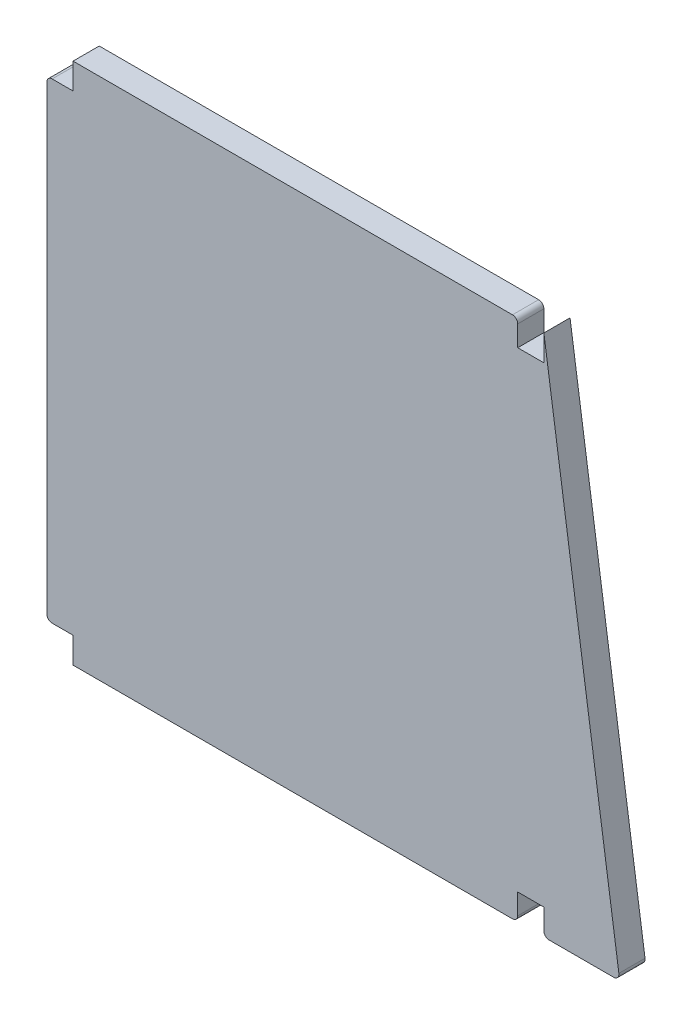
ISO-10303-21;
HEADER;
FILE_DESCRIPTION(('STEP AP214'),'2;1');
FILE_NAME('part.step','',(''),(''),'','','');
FILE_SCHEMA(('AUTOMOTIVE_DESIGN { 1 0 10303 214 1 1 1 1 }'));
ENDSEC;
DATA;
#1=APPLICATION_CONTEXT('core data for automotive mechanical design processes');
#2=APPLICATION_PROTOCOL_DEFINITION('international standard','automotive_design',2000,#1);
#3=PRODUCT_CONTEXT('',#1,'mechanical');
#4=PRODUCT('Part','Part','',(#3));
#5=PRODUCT_RELATED_PRODUCT_CATEGORY('part','',(#4));
#6=PRODUCT_DEFINITION_FORMATION('','',#4);
#7=PRODUCT_DEFINITION_CONTEXT('part definition',#1,'design');
#8=PRODUCT_DEFINITION('design','',#6,#7);
#9=PRODUCT_DEFINITION_SHAPE('','',#8);
#10=(LENGTH_UNIT() NAMED_UNIT(*) SI_UNIT(.MILLI.,.METRE.));
#11=(NAMED_UNIT(*) PLANE_ANGLE_UNIT() SI_UNIT($,.RADIAN.));
#12=(NAMED_UNIT(*) SI_UNIT($,.STERADIAN.) SOLID_ANGLE_UNIT());
#13=UNCERTAINTY_MEASURE_WITH_UNIT(LENGTH_MEASURE(1.E-05),#10,'distance_accuracy_value','');
#14=(GEOMETRIC_REPRESENTATION_CONTEXT(3) GLOBAL_UNCERTAINTY_ASSIGNED_CONTEXT((#13)) GLOBAL_UNIT_ASSIGNED_CONTEXT((#10,
#11,#12)) REPRESENTATION_CONTEXT('',''));
#15=CARTESIAN_POINT('',(0.,0.,0.));
#16=DIRECTION('',(0.,0.,1.));
#17=DIRECTION('',(1.,0.,0.));
#18=AXIS2_PLACEMENT_3D('',#15,#16,#17);
#19=CARTESIAN_POINT('',(0.,0.,5.));
#20=DIRECTION('',(1.,0.,0.));
#21=DIRECTION('',(0.,1.,0.));
#22=AXIS2_PLACEMENT_3D('',#19,#20,#21);
#23=PLANE('',#22);
#24=DIRECTION('',(0.,-1.,0.));
#25=VECTOR('',#24,1.);
#26=CARTESIAN_POINT('',(0.,0.,0.));
#27=LINE('',#26,#25);
#28=CARTESIAN_POINT('',(0.,4.95,0.));
#29=VERTEX_POINT('',#28);
#30=CARTESIAN_POINT('',(0.,0.,0.));
#31=VERTEX_POINT('',#30);
#32=EDGE_CURVE('E206',#29,#31,#27,.T.);
#33=ORIENTED_EDGE('',*,*,#32,.T.);
#34=DIRECTION('',(0.,0.,-1.));
#35=VECTOR('',#34,1.);
#36=CARTESIAN_POINT('',(0.,0.,5.));
#37=LINE('',#36,#35);
#38=CARTESIAN_POINT('',(0.,0.,5.));
#39=VERTEX_POINT('',#38);
#40=EDGE_CURVE('E188',#39,#31,#37,.T.);
#41=ORIENTED_EDGE('',*,*,#40,.F.);
#42=DIRECTION('',(0.,-1.,0.));
#43=VECTOR('',#42,1.);
#44=CARTESIAN_POINT('',(0.,0.,5.));
#45=LINE('',#44,#43);
#46=CARTESIAN_POINT('',(0.,4.95,5.));
#47=VERTEX_POINT('',#46);
#48=EDGE_CURVE('E194',#47,#39,#45,.T.);
#49=ORIENTED_EDGE('',*,*,#48,.F.);
#50=DIRECTION('',(0.,0.,-1.));
#51=VECTOR('',#50,1.);
#52=CARTESIAN_POINT('',(0.,4.95,5.));
#53=LINE('',#52,#51);
#54=EDGE_CURVE('E281',#47,#29,#53,.T.);
#55=ORIENTED_EDGE('',*,*,#54,.T.);
#56=EDGE_LOOP('',(#33,#41,#49,#55));
#57=FACE_BOUND('',#56,.T.);
#58=ADVANCED_FACE('F40',(#57),#23,.F.);
#59=CARTESIAN_POINT('',(0.,0.,5.));
#60=DIRECTION('',(0.,1.,0.));
#61=DIRECTION('',(0.,0.,1.));
#62=AXIS2_PLACEMENT_3D('',#59,#60,#61);
#63=PLANE('',#62);
#64=DIRECTION('',(1.,0.,0.));
#65=VECTOR('',#64,1.);
#66=CARTESIAN_POINT('',(0.,0.,0.));
#67=LINE('',#66,#65);
#68=CARTESIAN_POINT('',(84.,0.,0.));
#69=VERTEX_POINT('',#68);
#70=EDGE_CURVE('E353',#31,#69,#67,.T.);
#71=ORIENTED_EDGE('',*,*,#70,.T.);
#72=DIRECTION('',(0.,0.,-1.));
#73=VECTOR('',#72,1.);
#74=CARTESIAN_POINT('',(84.,0.,5.));
#75=LINE('',#74,#73);
#76=CARTESIAN_POINT('',(84.,0.,5.));
#77=VERTEX_POINT('',#76);
#78=EDGE_CURVE('E191',#69,#77,#75,.F.);
#79=ORIENTED_EDGE('',*,*,#78,.T.);
#80=DIRECTION('',(1.,0.,0.));
#81=VECTOR('',#80,1.);
#82=CARTESIAN_POINT('',(0.,0.,5.));
#83=LINE('',#82,#81);
#84=EDGE_CURVE('E183',#39,#77,#83,.T.);
#85=ORIENTED_EDGE('',*,*,#84,.F.);
#86=ORIENTED_EDGE('',*,*,#40,.T.);
#87=EDGE_LOOP('',(#71,#79,#85,#86));
#88=FACE_BOUND('',#87,.T.);
#89=ADVANCED_FACE('F186',(#88),#63,.F.);
#90=CARTESIAN_POINT('',(85.,0.,5.));
#91=DIRECTION('',(-1.,0.,0.));
#92=DIRECTION('',(0.,0.,1.));
#93=AXIS2_PLACEMENT_3D('',#90,#91,#92);
#94=PLANE('',#93);
#95=DIRECTION('',(0.,1.,0.));
#96=VECTOR('',#95,1.);
#97=CARTESIAN_POINT('',(85.,0.,5.));
#98=LINE('',#97,#96);
#99=CARTESIAN_POINT('',(85.,1.,5.));
#100=VERTEX_POINT('',#99);
#101=CARTESIAN_POINT('',(85.,4.95,5.));
#102=VERTEX_POINT('',#101);
#103=EDGE_CURVE('E193',#100,#102,#98,.T.);
#104=ORIENTED_EDGE('',*,*,#103,.F.);
#105=DIRECTION('',(0.,0.,-1.));
#106=VECTOR('',#105,1.);
#107=CARTESIAN_POINT('',(85.,1.,5.));
#108=LINE('',#107,#106);
#109=CARTESIAN_POINT('',(85.,1.,0.));
#110=VERTEX_POINT('',#109);
#111=EDGE_CURVE('E252',#100,#110,#108,.T.);
#112=ORIENTED_EDGE('',*,*,#111,.T.);
#113=DIRECTION('',(0.,1.,0.));
#114=VECTOR('',#113,1.);
#115=CARTESIAN_POINT('',(85.,0.,0.));
#116=LINE('',#115,#114);
#117=CARTESIAN_POINT('',(85.,4.95,0.));
#118=VERTEX_POINT('',#117);
#119=EDGE_CURVE('E319',#110,#118,#116,.T.);
#120=ORIENTED_EDGE('',*,*,#119,.T.);
#121=DIRECTION('',(0.,0.,-1.));
#122=VECTOR('',#121,1.);
#123=CARTESIAN_POINT('',(85.,4.95,5.));
#124=LINE('',#123,#122);
#125=EDGE_CURVE('E208',#102,#118,#124,.T.);
#126=ORIENTED_EDGE('',*,*,#125,.F.);
#127=EDGE_LOOP('',(#104,#112,#120,#126));
#128=FACE_BOUND('',#127,.T.);
#129=ADVANCED_FACE('F357',(#128),#94,.F.);
#130=CARTESIAN_POINT('',(85.,4.95,5.));
#131=DIRECTION('',(0.,1.,0.));
#132=DIRECTION('',(0.,0.,1.));
#133=AXIS2_PLACEMENT_3D('',#130,#131,#132);
#134=PLANE('',#133);
#135=DIRECTION('',(1.,0.,0.));
#136=VECTOR('',#135,1.);
#137=CARTESIAN_POINT('',(85.,4.95,0.));
#138=LINE('',#137,#136);
#139=CARTESIAN_POINT('',(90.,4.95,0.));
#140=VERTEX_POINT('',#139);
#141=EDGE_CURVE('E312',#118,#140,#138,.T.);
#142=ORIENTED_EDGE('',*,*,#141,.T.);
#143=DIRECTION('',(0.,0.,-1.));
#144=VECTOR('',#143,1.);
#145=CARTESIAN_POINT('',(90.,4.95,5.));
#146=LINE('',#145,#144);
#147=CARTESIAN_POINT('',(90.,4.95,5.));
#148=VERTEX_POINT('',#147);
#149=EDGE_CURVE('E214',#148,#140,#146,.T.);
#150=ORIENTED_EDGE('',*,*,#149,.F.);
#151=DIRECTION('',(1.,0.,0.));
#152=VECTOR('',#151,1.);
#153=CARTESIAN_POINT('',(85.,4.95,5.));
#154=LINE('',#153,#152);
#155=EDGE_CURVE('E360',#102,#148,#154,.T.);
#156=ORIENTED_EDGE('',*,*,#155,.F.);
#157=ORIENTED_EDGE('',*,*,#125,.T.);
#158=EDGE_LOOP('',(#142,#150,#156,#157));
#159=FACE_BOUND('',#158,.T.);
#160=ADVANCED_FACE('F359',(#159),#134,.F.);
#161=CARTESIAN_POINT('',(90.,4.95,5.));
#162=DIRECTION('',(1.,0.,0.));
#163=DIRECTION('',(0.,0.,-1.));
#164=AXIS2_PLACEMENT_3D('',#161,#162,#163);
#165=PLANE('',#164);
#166=DIRECTION('',(0.,-1.,0.));
#167=VECTOR('',#166,1.);
#168=CARTESIAN_POINT('',(90.,4.95,0.));
#169=LINE('',#168,#167);
#170=CARTESIAN_POINT('',(90.,1.,0.));
#171=VERTEX_POINT('',#170);
#172=EDGE_CURVE('E304',#140,#171,#169,.T.);
#173=ORIENTED_EDGE('',*,*,#172,.T.);
#174=DIRECTION('',(0.,0.,-1.));
#175=VECTOR('',#174,1.);
#176=CARTESIAN_POINT('',(90.,1.,5.));
#177=LINE('',#176,#175);
#178=CARTESIAN_POINT('',(90.,1.,5.));
#179=VERTEX_POINT('',#178);
#180=EDGE_CURVE('E250',#171,#179,#177,.F.);
#181=ORIENTED_EDGE('',*,*,#180,.T.);
#182=DIRECTION('',(0.,-1.,0.));
#183=VECTOR('',#182,1.);
#184=CARTESIAN_POINT('',(90.,4.95,5.));
#185=LINE('',#184,#183);
#186=EDGE_CURVE('E307',#148,#179,#185,.T.);
#187=ORIENTED_EDGE('',*,*,#186,.F.);
#188=ORIENTED_EDGE('',*,*,#149,.T.);
#189=EDGE_LOOP('',(#173,#181,#187,#188));
#190=FACE_BOUND('',#189,.T.);
#191=ADVANCED_FACE('F303',(#190),#165,.F.);
#192=CARTESIAN_POINT('',(90.,0.,5.));
#193=DIRECTION('',(0.,1.,0.));
#194=DIRECTION('',(0.,0.,1.));
#195=AXIS2_PLACEMENT_3D('',#192,#193,#194);
#196=PLANE('',#195);
#197=DIRECTION('',(1.,0.,0.));
#198=VECTOR('',#197,1.);
#199=CARTESIAN_POINT('',(90.,0.,0.));
#200=LINE('',#199,#198);
#201=CARTESIAN_POINT('',(91.,0.,0.));
#202=VERTEX_POINT('',#201);
#203=CARTESIAN_POINT('',(103.344542182969,0.,0.));
#204=VERTEX_POINT('',#203);
#205=EDGE_CURVE('E314',#202,#204,#200,.T.);
#206=ORIENTED_EDGE('',*,*,#205,.T.);
#207=DIRECTION('',(0.,0.,-1.));
#208=VECTOR('',#207,1.);
#209=CARTESIAN_POINT('',(103.344542182969,0.,5.));
#210=LINE('',#209,#208);
#211=CARTESIAN_POINT('',(103.344542182969,0.,5.));
#212=VERTEX_POINT('',#211);
#213=EDGE_CURVE('E248',#204,#212,#210,.F.);
#214=ORIENTED_EDGE('',*,*,#213,.T.);
#215=DIRECTION('',(1.,0.,0.));
#216=VECTOR('',#215,1.);
#217=CARTESIAN_POINT('',(90.,0.,5.));
#218=LINE('',#217,#216);
#219=CARTESIAN_POINT('',(91.,0.,5.));
#220=VERTEX_POINT('',#219);
#221=EDGE_CURVE('E362',#220,#212,#218,.T.);
#222=ORIENTED_EDGE('',*,*,#221,.F.);
#223=DIRECTION('',(0.,0.,-1.));
#224=VECTOR('',#223,1.);
#225=CARTESIAN_POINT('',(91.,0.,5.));
#226=LINE('',#225,#224);
#227=EDGE_CURVE('E245',#220,#202,#226,.T.);
#228=ORIENTED_EDGE('',*,*,#227,.T.);
#229=EDGE_LOOP('',(#206,#214,#222,#228));
#230=FACE_BOUND('',#229,.T.);
#231=ADVANCED_FACE('F413',(#230),#196,.F.);
#232=CARTESIAN_POINT('',(104.5,0.,5.));
#233=DIRECTION('',(-0.989650417013754,-0.143499310466994,0.));
#234=DIRECTION('',(0.143499310466994,-0.989650417013754,0.));
#235=AXIS2_PLACEMENT_3D('',#232,#233,#234);
#236=PLANE('',#235);
#237=DIRECTION('',(-0.143499310466994,0.989650417013754,0.));
#238=VECTOR('',#237,1.);
#239=CARTESIAN_POINT('',(104.5,0.,5.));
#240=LINE('',#239,#238);
#241=CARTESIAN_POINT('',(104.334192599982,1.143499310467,5.));
#242=VERTEX_POINT('',#241);
#243=CARTESIAN_POINT('',(90.,100.,5.));
#244=VERTEX_POINT('',#243);
#245=EDGE_CURVE('E368',#242,#244,#240,.T.);
#246=ORIENTED_EDGE('',*,*,#245,.F.);
#247=DIRECTION('',(0.,0.,-1.));
#248=VECTOR('',#247,1.);
#249=CARTESIAN_POINT('',(104.334192599982,1.143499310467,5.));
#250=LINE('',#249,#248);
#251=CARTESIAN_POINT('',(104.334192599982,1.143499310467,0.));
#252=VERTEX_POINT('',#251);
#253=EDGE_CURVE('E242',#242,#252,#250,.T.);
#254=ORIENTED_EDGE('',*,*,#253,.T.);
#255=DIRECTION('',(-0.143499310466994,0.989650417013754,0.));
#256=VECTOR('',#255,1.);
#257=CARTESIAN_POINT('',(104.5,0.,0.));
#258=LINE('',#257,#256);
#259=CARTESIAN_POINT('',(90.,100.,0.));
#260=VERTEX_POINT('',#259);
#261=EDGE_CURVE('E317',#252,#260,#258,.T.);
#262=ORIENTED_EDGE('',*,*,#261,.T.);
#263=DIRECTION('',(0.,0.,-1.));
#264=VECTOR('',#263,1.);
#265=CARTESIAN_POINT('',(90.,100.,5.));
#266=LINE('',#265,#264);
#267=EDGE_CURVE('E295',#244,#260,#266,.T.);
#268=ORIENTED_EDGE('',*,*,#267,.F.);
#269=EDGE_LOOP('',(#246,#254,#262,#268));
#270=FACE_BOUND('',#269,.T.);
#271=ADVANCED_FACE('F416',(#270),#236,.F.);
#272=CARTESIAN_POINT('',(90.,100.,5.));
#273=DIRECTION('',(1.,0.,0.));
#274=DIRECTION('',(0.,0.,-1.));
#275=AXIS2_PLACEMENT_3D('',#272,#273,#274);
#276=PLANE('',#275);
#277=DIRECTION('',(0.,-1.,0.));
#278=VECTOR('',#277,1.);
#279=CARTESIAN_POINT('',(90.,100.,0.));
#280=LINE('',#279,#278);
#281=CARTESIAN_POINT('',(90.,95.05,0.));
#282=VERTEX_POINT('',#281);
#283=EDGE_CURVE('E324',#260,#282,#280,.T.);
#284=ORIENTED_EDGE('',*,*,#283,.T.);
#285=DIRECTION('',(0.,0.,-1.));
#286=VECTOR('',#285,1.);
#287=CARTESIAN_POINT('',(90.,95.05,5.));
#288=LINE('',#287,#286);
#289=CARTESIAN_POINT('',(90.,95.05,5.));
#290=VERTEX_POINT('',#289);
#291=EDGE_CURVE('E292',#290,#282,#288,.T.);
#292=ORIENTED_EDGE('',*,*,#291,.F.);
#293=DIRECTION('',(0.,-1.,0.));
#294=VECTOR('',#293,1.);
#295=CARTESIAN_POINT('',(90.,100.,5.));
#296=LINE('',#295,#294);
#297=EDGE_CURVE('E370',#244,#290,#296,.T.);
#298=ORIENTED_EDGE('',*,*,#297,.F.);
#299=ORIENTED_EDGE('',*,*,#267,.T.);
#300=EDGE_LOOP('',(#284,#292,#298,#299));
#301=FACE_BOUND('',#300,.T.);
#302=ADVANCED_FACE('F420',(#301),#276,.F.);
#303=CARTESIAN_POINT('',(85.,95.05,5.));
#304=DIRECTION('',(0.,-1.,0.));
#305=DIRECTION('',(0.,0.,-1.));
#306=AXIS2_PLACEMENT_3D('',#303,#304,#305);
#307=PLANE('',#306);
#308=DIRECTION('',(-1.,0.,0.));
#309=VECTOR('',#308,1.);
#310=CARTESIAN_POINT('',(85.,95.05,0.));
#311=LINE('',#310,#309);
#312=CARTESIAN_POINT('',(85.,95.05,0.));
#313=VERTEX_POINT('',#312);
#314=EDGE_CURVE('E326',#282,#313,#311,.T.);
#315=ORIENTED_EDGE('',*,*,#314,.T.);
#316=DIRECTION('',(0.,0.,-1.));
#317=VECTOR('',#316,1.);
#318=CARTESIAN_POINT('',(85.,95.05,5.));
#319=LINE('',#318,#317);
#320=CARTESIAN_POINT('',(85.,95.05,5.));
#321=VERTEX_POINT('',#320);
#322=EDGE_CURVE('E289',#321,#313,#319,.T.);
#323=ORIENTED_EDGE('',*,*,#322,.F.);
#324=DIRECTION('',(-1.,0.,0.));
#325=VECTOR('',#324,1.);
#326=CARTESIAN_POINT('',(85.,95.05,5.));
#327=LINE('',#326,#325);
#328=EDGE_CURVE('E372',#290,#321,#327,.T.);
#329=ORIENTED_EDGE('',*,*,#328,.F.);
#330=ORIENTED_EDGE('',*,*,#291,.T.);
#331=EDGE_LOOP('',(#315,#323,#329,#330));
#332=FACE_BOUND('',#331,.T.);
#333=ADVANCED_FACE('F424',(#332),#307,.F.);
#334=CARTESIAN_POINT('',(85.,95.05,5.));
#335=DIRECTION('',(-1.,0.,0.));
#336=DIRECTION('',(0.,0.,1.));
#337=AXIS2_PLACEMENT_3D('',#334,#335,#336);
#338=PLANE('',#337);
#339=DIRECTION('',(0.,1.,0.));
#340=VECTOR('',#339,1.);
#341=CARTESIAN_POINT('',(85.,95.05,0.));
#342=LINE('',#341,#340);
#343=CARTESIAN_POINT('',(85.,99.,0.));
#344=VERTEX_POINT('',#343);
#345=EDGE_CURVE('E328',#313,#344,#342,.T.);
#346=ORIENTED_EDGE('',*,*,#345,.T.);
#347=DIRECTION('',(0.,0.,-1.));
#348=VECTOR('',#347,1.);
#349=CARTESIAN_POINT('',(85.,99.,5.));
#350=LINE('',#349,#348);
#351=CARTESIAN_POINT('',(85.,99.,5.));
#352=VERTEX_POINT('',#351);
#353=EDGE_CURVE('E229',#344,#352,#350,.F.);
#354=ORIENTED_EDGE('',*,*,#353,.T.);
#355=DIRECTION('',(0.,1.,0.));
#356=VECTOR('',#355,1.);
#357=CARTESIAN_POINT('',(85.,95.05,5.));
#358=LINE('',#357,#356);
#359=EDGE_CURVE('E374',#321,#352,#358,.T.);
#360=ORIENTED_EDGE('',*,*,#359,.F.);
#361=ORIENTED_EDGE('',*,*,#322,.T.);
#362=EDGE_LOOP('',(#346,#354,#360,#361));
#363=FACE_BOUND('',#362,.T.);
#364=ADVANCED_FACE('F385',(#363),#338,.F.);
#365=CARTESIAN_POINT('',(0.,100.,5.));
#366=DIRECTION('',(0.,-1.,0.));
#367=DIRECTION('',(0.,0.,-1.));
#368=AXIS2_PLACEMENT_3D('',#365,#366,#367);
#369=PLANE('',#368);
#370=DIRECTION('',(-1.,0.,0.));
#371=VECTOR('',#370,1.);
#372=CARTESIAN_POINT('',(0.,100.,5.));
#373=LINE('',#372,#371);
#374=CARTESIAN_POINT('',(84.,100.,5.));
#375=VERTEX_POINT('',#374);
#376=CARTESIAN_POINT('',(0.,100.,5.));
#377=VERTEX_POINT('',#376);
#378=EDGE_CURVE('E347',#375,#377,#373,.T.);
#379=ORIENTED_EDGE('',*,*,#378,.F.);
#380=DIRECTION('',(0.,0.,-1.));
#381=VECTOR('',#380,1.);
#382=CARTESIAN_POINT('',(84.,100.,5.));
#383=LINE('',#382,#381);
#384=CARTESIAN_POINT('',(84.,100.,0.));
#385=VERTEX_POINT('',#384);
#386=EDGE_CURVE('E207',#375,#385,#383,.T.);
#387=ORIENTED_EDGE('',*,*,#386,.T.);
#388=DIRECTION('',(-1.,0.,0.));
#389=VECTOR('',#388,1.);
#390=CARTESIAN_POINT('',(0.,100.,0.));
#391=LINE('',#390,#389);
#392=CARTESIAN_POINT('',(0.,100.,0.));
#393=VERTEX_POINT('',#392);
#394=EDGE_CURVE('E331',#385,#393,#391,.T.);
#395=ORIENTED_EDGE('',*,*,#394,.T.);
#396=DIRECTION('',(0.,0.,-1.));
#397=VECTOR('',#396,1.);
#398=CARTESIAN_POINT('',(0.,100.,5.));
#399=LINE('',#398,#397);
#400=EDGE_CURVE('E286',#377,#393,#399,.T.);
#401=ORIENTED_EDGE('',*,*,#400,.F.);
#402=EDGE_LOOP('',(#379,#387,#395,#401));
#403=FACE_BOUND('',#402,.T.);
#404=ADVANCED_FACE('F379',(#403),#369,.F.);
#405=CARTESIAN_POINT('',(0.,95.05,5.));
#406=DIRECTION('',(1.,0.,0.));
#407=DIRECTION('',(0.,1.,0.));
#408=AXIS2_PLACEMENT_3D('',#405,#406,#407);
#409=PLANE('',#408);
#410=DIRECTION('',(0.,-1.,0.));
#411=VECTOR('',#410,1.);
#412=CARTESIAN_POINT('',(0.,95.05,0.));
#413=LINE('',#412,#411);
#414=CARTESIAN_POINT('',(0.,95.05,0.));
#415=VERTEX_POINT('',#414);
#416=EDGE_CURVE('E277',#393,#415,#413,.T.);
#417=ORIENTED_EDGE('',*,*,#416,.T.);
#418=DIRECTION('',(0.,0.,-1.));
#419=VECTOR('',#418,1.);
#420=CARTESIAN_POINT('',(0.,95.05,5.));
#421=LINE('',#420,#419);
#422=CARTESIAN_POINT('',(0.,95.05,5.));
#423=VERTEX_POINT('',#422);
#424=EDGE_CURVE('E283',#423,#415,#421,.T.);
#425=ORIENTED_EDGE('',*,*,#424,.F.);
#426=DIRECTION('',(0.,-1.,0.));
#427=VECTOR('',#426,1.);
#428=CARTESIAN_POINT('',(0.,95.05,5.));
#429=LINE('',#428,#427);
#430=EDGE_CURVE('E344',#377,#423,#429,.T.);
#431=ORIENTED_EDGE('',*,*,#430,.F.);
#432=ORIENTED_EDGE('',*,*,#400,.T.);
#433=EDGE_LOOP('',(#417,#425,#431,#432));
#434=FACE_BOUND('',#433,.T.);
#435=ADVANCED_FACE('F335',(#434),#409,.F.);
#436=CARTESIAN_POINT('',(0.,95.05,5.));
#437=DIRECTION('',(0.,-1.,0.));
#438=DIRECTION('',(0.,0.,-1.));
#439=AXIS2_PLACEMENT_3D('',#436,#437,#438);
#440=PLANE('',#439);
#441=DIRECTION('',(-1.,0.,0.));
#442=VECTOR('',#441,1.);
#443=CARTESIAN_POINT('',(0.,95.05,0.));
#444=LINE('',#443,#442);
#445=CARTESIAN_POINT('',(-4.,95.05,0.));
#446=VERTEX_POINT('',#445);
#447=EDGE_CURVE('E274',#415,#446,#444,.T.);
#448=ORIENTED_EDGE('',*,*,#447,.T.);
#449=DIRECTION('',(0.,0.,-1.));
#450=VECTOR('',#449,1.);
#451=CARTESIAN_POINT('',(-4.,95.05,5.));
#452=LINE('',#451,#450);
#453=CARTESIAN_POINT('',(-4.,95.05,5.));
#454=VERTEX_POINT('',#453);
#455=EDGE_CURVE('E11',#446,#454,#452,.F.);
#456=ORIENTED_EDGE('',*,*,#455,.T.);
#457=DIRECTION('',(-1.,0.,0.));
#458=VECTOR('',#457,1.);
#459=CARTESIAN_POINT('',(0.,95.05,5.));
#460=LINE('',#459,#458);
#461=EDGE_CURVE('E343',#423,#454,#460,.T.);
#462=ORIENTED_EDGE('',*,*,#461,.F.);
#463=ORIENTED_EDGE('',*,*,#424,.T.);
#464=EDGE_LOOP('',(#448,#456,#462,#463));
#465=FACE_BOUND('',#464,.T.);
#466=ADVANCED_FACE('F340',(#465),#440,.F.);
#467=CARTESIAN_POINT('',(-5.,95.05,5.));
#468=DIRECTION('',(1.,0.,0.));
#469=DIRECTION('',(0.,1.,0.));
#470=AXIS2_PLACEMENT_3D('',#467,#468,#469);
#471=PLANE('',#470);
#472=DIRECTION('',(0.,-1.,0.));
#473=VECTOR('',#472,1.);
#474=CARTESIAN_POINT('',(-5.,95.05,0.));
#475=LINE('',#474,#473);
#476=CARTESIAN_POINT('',(-5.,94.05,0.));
#477=VERTEX_POINT('',#476);
#478=CARTESIAN_POINT('',(-4.99999999999999,5.95,0.));
#479=VERTEX_POINT('',#478);
#480=EDGE_CURVE('E264',#477,#479,#475,.T.);
#481=ORIENTED_EDGE('',*,*,#480,.T.);
#482=DIRECTION('',(0.,0.,-1.));
#483=VECTOR('',#482,1.);
#484=CARTESIAN_POINT('',(-4.99999999999999,5.95,5.));
#485=LINE('',#484,#483);
#486=CARTESIAN_POINT('',(-4.99999999999999,5.95,5.));
#487=VERTEX_POINT('',#486);
#488=EDGE_CURVE('E48',#479,#487,#485,.F.);
#489=ORIENTED_EDGE('',*,*,#488,.T.);
#490=DIRECTION('',(0.,-1.,0.));
#491=VECTOR('',#490,1.);
#492=CARTESIAN_POINT('',(-5.,95.05,5.));
#493=LINE('',#492,#491);
#494=CARTESIAN_POINT('',(-5.,94.05,5.));
#495=VERTEX_POINT('',#494);
#496=EDGE_CURVE('E265',#495,#487,#493,.T.);
#497=ORIENTED_EDGE('',*,*,#496,.F.);
#498=DIRECTION('',(0.,0.,-1.));
#499=VECTOR('',#498,1.);
#500=CARTESIAN_POINT('',(-5.,94.05,5.));
#501=LINE('',#500,#499);
#502=EDGE_CURVE('E259',#495,#477,#501,.T.);
#503=ORIENTED_EDGE('',*,*,#502,.T.);
#504=EDGE_LOOP('',(#481,#489,#497,#503));
#505=FACE_BOUND('',#504,.T.);
#506=ADVANCED_FACE('F263',(#505),#471,.F.);
#507=CARTESIAN_POINT('',(0.,4.95,5.));
#508=DIRECTION('',(0.,1.,0.));
#509=DIRECTION('',(-1.,0.,0.));
#510=AXIS2_PLACEMENT_3D('',#507,#508,#509);
#511=PLANE('',#510);
#512=DIRECTION('',(1.,0.,0.));
#513=VECTOR('',#512,1.);
#514=CARTESIAN_POINT('',(0.,4.95,5.));
#515=LINE('',#514,#513);
#516=CARTESIAN_POINT('',(-3.99999999999999,4.95,5.));
#517=VERTEX_POINT('',#516);
#518=EDGE_CURVE('E199',#517,#47,#515,.T.);
#519=ORIENTED_EDGE('',*,*,#518,.F.);
#520=DIRECTION('',(0.,0.,-1.));
#521=VECTOR('',#520,1.);
#522=CARTESIAN_POINT('',(-3.99999999999999,4.95,5.));
#523=LINE('',#522,#521);
#524=CARTESIAN_POINT('',(-3.99999999999999,4.95,0.));
#525=VERTEX_POINT('',#524);
#526=EDGE_CURVE('E256',#517,#525,#523,.T.);
#527=ORIENTED_EDGE('',*,*,#526,.T.);
#528=DIRECTION('',(1.,0.,0.));
#529=VECTOR('',#528,1.);
#530=CARTESIAN_POINT('',(0.,4.95,0.));
#531=LINE('',#530,#529);
#532=EDGE_CURVE('E203',#525,#29,#531,.T.);
#533=ORIENTED_EDGE('',*,*,#532,.T.);
#534=ORIENTED_EDGE('',*,*,#54,.F.);
#535=EDGE_LOOP('',(#519,#527,#533,#534));
#536=FACE_BOUND('',#535,.T.);
#537=ADVANCED_FACE('F439',(#536),#511,.F.);
#538=CARTESIAN_POINT('',(0.,0.,5.));
#539=DIRECTION('',(0.,0.,1.));
#540=DIRECTION('',(1.,0.,0.));
#541=AXIS2_PLACEMENT_3D('',#538,#539,#540);
#542=PLANE('',#541);
#543=ORIENTED_EDGE('',*,*,#359,.T.);
#544=CARTESIAN_POINT('',(84.,99.,5.));
#545=DIRECTION('',(0.,0.,1.));
#546=DIRECTION('',(1.,0.,0.));
#547=AXIS2_PLACEMENT_3D('',#544,#545,#546);
#548=CIRCLE('',#547,1.);
#549=EDGE_CURVE('E240',#352,#375,#548,.T.);
#550=ORIENTED_EDGE('',*,*,#549,.T.);
#551=ORIENTED_EDGE('',*,*,#378,.T.);
#552=ORIENTED_EDGE('',*,*,#430,.T.);
#553=ORIENTED_EDGE('',*,*,#461,.T.);
#554=CARTESIAN_POINT('',(-4.,94.05,5.));
#555=DIRECTION('',(0.,0.,1.));
#556=DIRECTION('',(1.,0.,0.));
#557=AXIS2_PLACEMENT_3D('',#554,#555,#556);
#558=CIRCLE('',#557,1.);
#559=EDGE_CURVE('E231',#454,#495,#558,.T.);
#560=ORIENTED_EDGE('',*,*,#559,.T.);
#561=ORIENTED_EDGE('',*,*,#496,.T.);
#562=CARTESIAN_POINT('',(-3.99999999999999,5.95,5.));
#563=DIRECTION('',(0.,0.,1.));
#564=DIRECTION('',(1.,0.,0.));
#565=AXIS2_PLACEMENT_3D('',#562,#563,#564);
#566=CIRCLE('',#565,1.);
#567=EDGE_CURVE('E55',#487,#517,#566,.T.);
#568=ORIENTED_EDGE('',*,*,#567,.T.);
#569=ORIENTED_EDGE('',*,*,#518,.T.);
#570=ORIENTED_EDGE('',*,*,#48,.T.);
#571=ORIENTED_EDGE('',*,*,#84,.T.);
#572=CARTESIAN_POINT('',(84.,1.,5.));
#573=DIRECTION('',(0.,0.,1.));
#574=DIRECTION('',(1.,0.,0.));
#575=AXIS2_PLACEMENT_3D('',#572,#573,#574);
#576=CIRCLE('',#575,1.);
#577=EDGE_CURVE('E234',#77,#100,#576,.T.);
#578=ORIENTED_EDGE('',*,*,#577,.T.);
#579=ORIENTED_EDGE('',*,*,#103,.T.);
#580=ORIENTED_EDGE('',*,*,#155,.T.);
#581=ORIENTED_EDGE('',*,*,#186,.T.);
#582=CARTESIAN_POINT('',(91.,1.,5.));
#583=DIRECTION('',(0.,0.,1.));
#584=DIRECTION('',(1.,0.,0.));
#585=AXIS2_PLACEMENT_3D('',#582,#583,#584);
#586=CIRCLE('',#585,1.);
#587=EDGE_CURVE('E236',#179,#220,#586,.T.);
#588=ORIENTED_EDGE('',*,*,#587,.T.);
#589=ORIENTED_EDGE('',*,*,#221,.T.);
#590=CARTESIAN_POINT('',(103.344542182969,1.,5.));
#591=DIRECTION('',(0.,0.,1.));
#592=DIRECTION('',(1.,0.,0.));
#593=AXIS2_PLACEMENT_3D('',#590,#591,#592);
#594=CIRCLE('',#593,1.);
#595=EDGE_CURVE('E238',#212,#242,#594,.T.);
#596=ORIENTED_EDGE('',*,*,#595,.T.);
#597=ORIENTED_EDGE('',*,*,#245,.T.);
#598=ORIENTED_EDGE('',*,*,#297,.T.);
#599=ORIENTED_EDGE('',*,*,#328,.T.);
#600=EDGE_LOOP('',(#543,#550,#551,#552,#553,#560,#561,#568,#569,#570,#571,#578,#579,#580,#581,
#588,#589,#596,#597,#598,#599));
#601=FACE_BOUND('',#600,.T.);
#602=ADVANCED_FACE('F198',(#601),#542,.T.);
#603=CARTESIAN_POINT('',(0.,0.,0.));
#604=DIRECTION('',(0.,0.,1.));
#605=DIRECTION('',(1.,0.,0.));
#606=AXIS2_PLACEMENT_3D('',#603,#604,#605);
#607=PLANE('',#606);
#608=ORIENTED_EDGE('',*,*,#394,.F.);
#609=CARTESIAN_POINT('',(84.,99.,0.));
#610=DIRECTION('',(0.,0.,1.));
#611=DIRECTION('',(1.,0.,0.));
#612=AXIS2_PLACEMENT_3D('',#609,#610,#611);
#613=CIRCLE('',#612,1.);
#614=EDGE_CURVE('E227',#385,#344,#613,.F.);
#615=ORIENTED_EDGE('',*,*,#614,.T.);
#616=ORIENTED_EDGE('',*,*,#345,.F.);
#617=ORIENTED_EDGE('',*,*,#314,.F.);
#618=ORIENTED_EDGE('',*,*,#283,.F.);
#619=ORIENTED_EDGE('',*,*,#261,.F.);
#620=CARTESIAN_POINT('',(103.344542182969,1.,0.));
#621=DIRECTION('',(0.,0.,1.));
#622=DIRECTION('',(1.,0.,0.));
#623=AXIS2_PLACEMENT_3D('',#620,#621,#622);
#624=CIRCLE('',#623,1.);
#625=EDGE_CURVE('E225',#252,#204,#624,.F.);
#626=ORIENTED_EDGE('',*,*,#625,.T.);
#627=ORIENTED_EDGE('',*,*,#205,.F.);
#628=CARTESIAN_POINT('',(91.,1.,0.));
#629=DIRECTION('',(0.,0.,1.));
#630=DIRECTION('',(1.,0.,0.));
#631=AXIS2_PLACEMENT_3D('',#628,#629,#630);
#632=CIRCLE('',#631,1.);
#633=EDGE_CURVE('E223',#202,#171,#632,.F.);
#634=ORIENTED_EDGE('',*,*,#633,.T.);
#635=ORIENTED_EDGE('',*,*,#172,.F.);
#636=ORIENTED_EDGE('',*,*,#141,.F.);
#637=ORIENTED_EDGE('',*,*,#119,.F.);
#638=CARTESIAN_POINT('',(84.,1.,0.));
#639=DIRECTION('',(0.,0.,1.));
#640=DIRECTION('',(1.,0.,0.));
#641=AXIS2_PLACEMENT_3D('',#638,#639,#640);
#642=CIRCLE('',#641,1.);
#643=EDGE_CURVE('E221',#110,#69,#642,.F.);
#644=ORIENTED_EDGE('',*,*,#643,.T.);
#645=ORIENTED_EDGE('',*,*,#70,.F.);
#646=ORIENTED_EDGE('',*,*,#32,.F.);
#647=ORIENTED_EDGE('',*,*,#532,.F.);
#648=CARTESIAN_POINT('',(-3.99999999999999,5.95,0.));
#649=DIRECTION('',(0.,0.,1.));
#650=DIRECTION('',(1.,0.,0.));
#651=AXIS2_PLACEMENT_3D('',#648,#649,#650);
#652=CIRCLE('',#651,1.);
#653=EDGE_CURVE('E219',#525,#479,#652,.F.);
#654=ORIENTED_EDGE('',*,*,#653,.T.);
#655=ORIENTED_EDGE('',*,*,#480,.F.);
#656=CARTESIAN_POINT('',(-4.,94.05,0.));
#657=DIRECTION('',(0.,0.,1.));
#658=DIRECTION('',(1.,0.,0.));
#659=AXIS2_PLACEMENT_3D('',#656,#657,#658);
#660=CIRCLE('',#659,1.);
#661=EDGE_CURVE('E211',#477,#446,#660,.F.);
#662=ORIENTED_EDGE('',*,*,#661,.T.);
#663=ORIENTED_EDGE('',*,*,#447,.F.);
#664=ORIENTED_EDGE('',*,*,#416,.F.);
#665=EDGE_LOOP('',(#608,#615,#616,#617,#618,#619,#626,#627,#634,#635,#636,#637,#644,#645,#646,
#647,#654,#655,#662,#663,#664));
#666=FACE_BOUND('',#665,.T.);
#667=ADVANCED_FACE('F270',(#666),#607,.F.);
#668=CARTESIAN_POINT('',(84.,99.,5.));
#669=DIRECTION('',(0.,0.,-1.));
#670=DIRECTION('',(-1.,0.,0.));
#671=AXIS2_PLACEMENT_3D('',#668,#669,#670);
#672=CYLINDRICAL_SURFACE('',#671,1.);
#673=ORIENTED_EDGE('',*,*,#549,.F.);
#674=ORIENTED_EDGE('',*,*,#353,.F.);
#675=ORIENTED_EDGE('',*,*,#614,.F.);
#676=ORIENTED_EDGE('',*,*,#386,.F.);
#677=EDGE_LOOP('',(#673,#674,#675,#676));
#678=FACE_BOUND('',#677,.T.);
#679=ADVANCED_FACE('F388',(#678),#672,.T.);
#680=CARTESIAN_POINT('',(103.344542182969,1.,5.));
#681=DIRECTION('',(0.,0.,-1.));
#682=DIRECTION('',(-1.,0.,0.));
#683=AXIS2_PLACEMENT_3D('',#680,#681,#682);
#684=CYLINDRICAL_SURFACE('',#683,1.);
#685=ORIENTED_EDGE('',*,*,#595,.F.);
#686=ORIENTED_EDGE('',*,*,#213,.F.);
#687=ORIENTED_EDGE('',*,*,#625,.F.);
#688=ORIENTED_EDGE('',*,*,#253,.F.);
#689=EDGE_LOOP('',(#685,#686,#687,#688));
#690=FACE_BOUND('',#689,.T.);
#691=ADVANCED_FACE('F390',(#690),#684,.T.);
#692=CARTESIAN_POINT('',(91.,1.,5.));
#693=DIRECTION('',(0.,0.,-1.));
#694=DIRECTION('',(-1.,0.,0.));
#695=AXIS2_PLACEMENT_3D('',#692,#693,#694);
#696=CYLINDRICAL_SURFACE('',#695,1.);
#697=ORIENTED_EDGE('',*,*,#587,.F.);
#698=ORIENTED_EDGE('',*,*,#180,.F.);
#699=ORIENTED_EDGE('',*,*,#633,.F.);
#700=ORIENTED_EDGE('',*,*,#227,.F.);
#701=EDGE_LOOP('',(#697,#698,#699,#700));
#702=FACE_BOUND('',#701,.T.);
#703=ADVANCED_FACE('F396',(#702),#696,.T.);
#704=CARTESIAN_POINT('',(84.,1.,5.));
#705=DIRECTION('',(0.,0.,-1.));
#706=DIRECTION('',(-1.,0.,0.));
#707=AXIS2_PLACEMENT_3D('',#704,#705,#706);
#708=CYLINDRICAL_SURFACE('',#707,1.);
#709=ORIENTED_EDGE('',*,*,#577,.F.);
#710=ORIENTED_EDGE('',*,*,#78,.F.);
#711=ORIENTED_EDGE('',*,*,#643,.F.);
#712=ORIENTED_EDGE('',*,*,#111,.F.);
#713=EDGE_LOOP('',(#709,#710,#711,#712));
#714=FACE_BOUND('',#713,.T.);
#715=ADVANCED_FACE('F476',(#714),#708,.T.);
#716=CARTESIAN_POINT('',(-3.99999999999999,5.95,5.));
#717=DIRECTION('',(0.,0.,-1.));
#718=DIRECTION('',(-1.,0.,0.));
#719=AXIS2_PLACEMENT_3D('',#716,#717,#718);
#720=CYLINDRICAL_SURFACE('',#719,1.);
#721=ORIENTED_EDGE('',*,*,#567,.F.);
#722=ORIENTED_EDGE('',*,*,#488,.F.);
#723=ORIENTED_EDGE('',*,*,#653,.F.);
#724=ORIENTED_EDGE('',*,*,#526,.F.);
#725=EDGE_LOOP('',(#721,#722,#723,#724));
#726=FACE_BOUND('',#725,.T.);
#727=ADVANCED_FACE('F486',(#726),#720,.T.);
#728=CARTESIAN_POINT('',(-4.,94.05,5.));
#729=DIRECTION('',(0.,0.,-1.));
#730=DIRECTION('',(-1.,0.,0.));
#731=AXIS2_PLACEMENT_3D('',#728,#729,#730);
#732=CYLINDRICAL_SURFACE('',#731,1.);
#733=ORIENTED_EDGE('',*,*,#559,.F.);
#734=ORIENTED_EDGE('',*,*,#455,.F.);
#735=ORIENTED_EDGE('',*,*,#661,.F.);
#736=ORIENTED_EDGE('',*,*,#502,.F.);
#737=EDGE_LOOP('',(#733,#734,#735,#736));
#738=FACE_BOUND('',#737,.T.);
#739=ADVANCED_FACE('F42',(#738),#732,.T.);
#740=CLOSED_SHELL('',(#58,#89,#129,#160,#191,#231,#271,#302,#333,#364,#404,#435,#466,#506,#537,
#602,#667,#679,#691,#703,#715,#727,#739));
#741=MANIFOLD_SOLID_BREP('B2',#740);
#742=ADVANCED_BREP_SHAPE_REPRESENTATION('',(#18,#741),#14);
#743=SHAPE_DEFINITION_REPRESENTATION(#9,#742);
ENDSEC;
END-ISO-10303-21;
